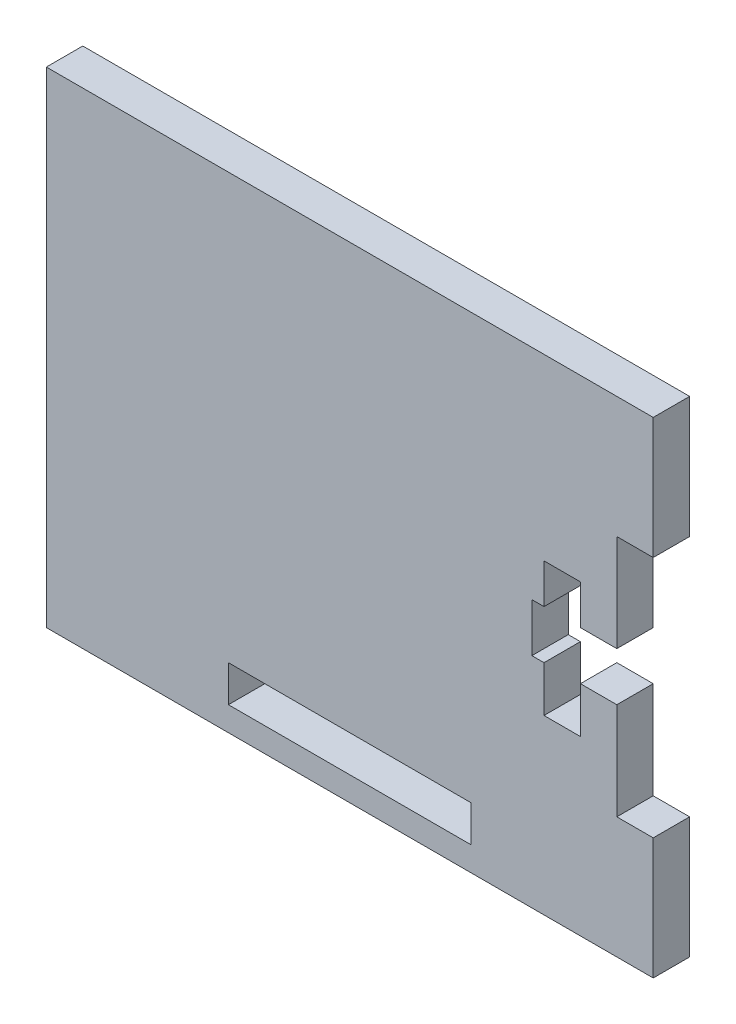
ISO-10303-21;
HEADER;
FILE_DESCRIPTION(('STEP AP214'),'2;1');
FILE_NAME('part.step','',(''),(''),'','','');
FILE_SCHEMA(('AUTOMOTIVE_DESIGN { 1 0 10303 214 1 1 1 1 }'));
ENDSEC;
DATA;
#1=APPLICATION_CONTEXT('core data for automotive mechanical design processes');
#2=APPLICATION_PROTOCOL_DEFINITION('international standard','automotive_design',2000,#1);
#3=PRODUCT_CONTEXT('',#1,'mechanical');
#4=PRODUCT('Part','Part','',(#3));
#5=PRODUCT_RELATED_PRODUCT_CATEGORY('part','',(#4));
#6=PRODUCT_DEFINITION_FORMATION('','',#4);
#7=PRODUCT_DEFINITION_CONTEXT('part definition',#1,'design');
#8=PRODUCT_DEFINITION('design','',#6,#7);
#9=PRODUCT_DEFINITION_SHAPE('','',#8);
#10=(LENGTH_UNIT() NAMED_UNIT(*) SI_UNIT(.MILLI.,.METRE.));
#11=(NAMED_UNIT(*) PLANE_ANGLE_UNIT() SI_UNIT($,.RADIAN.));
#12=(NAMED_UNIT(*) SI_UNIT($,.STERADIAN.) SOLID_ANGLE_UNIT());
#13=UNCERTAINTY_MEASURE_WITH_UNIT(LENGTH_MEASURE(1.E-05),#10,'distance_accuracy_value','');
#14=(GEOMETRIC_REPRESENTATION_CONTEXT(3) GLOBAL_UNCERTAINTY_ASSIGNED_CONTEXT((#13)) GLOBAL_UNIT_ASSIGNED_CONTEXT((#10,
#11,#12)) REPRESENTATION_CONTEXT('',''));
#15=CARTESIAN_POINT('',(0.,0.,0.));
#16=DIRECTION('',(0.,0.,1.));
#17=DIRECTION('',(1.,0.,0.));
#18=AXIS2_PLACEMENT_3D('',#15,#16,#17);
#19=CARTESIAN_POINT('',(0.,0.,1.5));
#20=DIRECTION('',(0.,0.,1.));
#21=DIRECTION('',(1.,0.,0.));
#22=AXIS2_PLACEMENT_3D('',#19,#20,#21);
#23=PLANE('',#22);
#24=DIRECTION('',(0.,-1.,0.));
#25=VECTOR('',#24,1.);
#26=CARTESIAN_POINT('',(-25.,20.,1.5));
#27=LINE('',#26,#25);
#28=CARTESIAN_POINT('',(-25.,20.,1.5));
#29=VERTEX_POINT('',#28);
#30=CARTESIAN_POINT('',(-25.,-20.,1.5));
#31=VERTEX_POINT('',#30);
#32=EDGE_CURVE('E232',#29,#31,#27,.T.);
#33=ORIENTED_EDGE('',*,*,#32,.T.);
#34=DIRECTION('',(1.,0.,0.));
#35=VECTOR('',#34,1.);
#36=CARTESIAN_POINT('',(-25.,-20.,1.5));
#37=LINE('',#36,#35);
#38=CARTESIAN_POINT('',(25.,-20.,1.5));
#39=VERTEX_POINT('',#38);
#40=EDGE_CURVE('E235',#31,#39,#37,.T.);
#41=ORIENTED_EDGE('',*,*,#40,.T.);
#42=DIRECTION('',(0.,1.,0.));
#43=VECTOR('',#42,1.);
#44=CARTESIAN_POINT('',(25.,-10.,1.5));
#45=LINE('',#44,#43);
#46=CARTESIAN_POINT('',(25.,-10.,1.5));
#47=VERTEX_POINT('',#46);
#48=EDGE_CURVE('E238',#39,#47,#45,.T.);
#49=ORIENTED_EDGE('',*,*,#48,.T.);
#50=DIRECTION('',(-1.,0.,0.));
#51=VECTOR('',#50,1.);
#52=CARTESIAN_POINT('',(25.,-10.,1.5));
#53=LINE('',#52,#51);
#54=CARTESIAN_POINT('',(22.,-10.,1.5));
#55=VERTEX_POINT('',#54);
#56=EDGE_CURVE('E240',#47,#55,#53,.T.);
#57=ORIENTED_EDGE('',*,*,#56,.T.);
#58=DIRECTION('',(0.,1.,0.));
#59=VECTOR('',#58,1.);
#60=CARTESIAN_POINT('',(22.,-2.,1.5));
#61=LINE('',#60,#59);
#62=CARTESIAN_POINT('',(22.,-2.,1.5));
#63=VERTEX_POINT('',#62);
#64=EDGE_CURVE('E242',#55,#63,#61,.T.);
#65=ORIENTED_EDGE('',*,*,#64,.T.);
#66=DIRECTION('',(-1.,0.,0.));
#67=VECTOR('',#66,1.);
#68=CARTESIAN_POINT('',(22.,-2.,1.5));
#69=LINE('',#68,#67);
#70=CARTESIAN_POINT('',(19.,-2.,1.5));
#71=VERTEX_POINT('',#70);
#72=EDGE_CURVE('E244',#63,#71,#69,.T.);
#73=ORIENTED_EDGE('',*,*,#72,.T.);
#74=DIRECTION('',(0.,-1.,0.));
#75=VECTOR('',#74,1.);
#76=CARTESIAN_POINT('',(19.,-2.,1.5));
#77=LINE('',#76,#75);
#78=CARTESIAN_POINT('',(19.,-5.76969494185854,1.5));
#79=VERTEX_POINT('',#78);
#80=EDGE_CURVE('E246',#71,#79,#77,.T.);
#81=ORIENTED_EDGE('',*,*,#80,.T.);
#82=DIRECTION('',(-1.,0.,0.));
#83=VECTOR('',#82,1.);
#84=CARTESIAN_POINT('',(16.,-5.76969494185854,1.5));
#85=LINE('',#84,#83);
#86=CARTESIAN_POINT('',(16.,-5.76969494185854,1.5));
#87=VERTEX_POINT('',#86);
#88=EDGE_CURVE('E248',#79,#87,#85,.T.);
#89=ORIENTED_EDGE('',*,*,#88,.T.);
#90=DIRECTION('',(0.,1.,0.));
#91=VECTOR('',#90,1.);
#92=CARTESIAN_POINT('',(16.,-2.,1.5));
#93=LINE('',#92,#91);
#94=CARTESIAN_POINT('',(16.,-2.,1.5));
#95=VERTEX_POINT('',#94);
#96=EDGE_CURVE('E250',#87,#95,#93,.T.);
#97=ORIENTED_EDGE('',*,*,#96,.T.);
#98=DIRECTION('',(-1.,0.,0.));
#99=VECTOR('',#98,1.);
#100=CARTESIAN_POINT('',(16.,-2.,1.5));
#101=LINE('',#100,#99);
#102=CARTESIAN_POINT('',(15.,-2.,1.5));
#103=VERTEX_POINT('',#102);
#104=EDGE_CURVE('E252',#95,#103,#101,.T.);
#105=ORIENTED_EDGE('',*,*,#104,.T.);
#106=DIRECTION('',(0.,1.,0.));
#107=VECTOR('',#106,1.);
#108=CARTESIAN_POINT('',(15.,2.,1.5));
#109=LINE('',#108,#107);
#110=CARTESIAN_POINT('',(15.,2.,1.5));
#111=VERTEX_POINT('',#110);
#112=EDGE_CURVE('E254',#103,#111,#109,.T.);
#113=ORIENTED_EDGE('',*,*,#112,.T.);
#114=DIRECTION('',(1.,0.,0.));
#115=VECTOR('',#114,1.);
#116=CARTESIAN_POINT('',(16.,2.,1.5));
#117=LINE('',#116,#115);
#118=CARTESIAN_POINT('',(16.,2.,1.5));
#119=VERTEX_POINT('',#118);
#120=EDGE_CURVE('E256',#111,#119,#117,.T.);
#121=ORIENTED_EDGE('',*,*,#120,.T.);
#122=DIRECTION('',(0.,1.,0.));
#123=VECTOR('',#122,1.);
#124=CARTESIAN_POINT('',(16.,5.26590984120979,1.5));
#125=LINE('',#124,#123);
#126=CARTESIAN_POINT('',(16.,5.26590984120979,1.5));
#127=VERTEX_POINT('',#126);
#128=EDGE_CURVE('E258',#119,#127,#125,.T.);
#129=ORIENTED_EDGE('',*,*,#128,.T.);
#130=DIRECTION('',(1.,0.,0.));
#131=VECTOR('',#130,1.);
#132=CARTESIAN_POINT('',(16.,5.26590984120979,1.5));
#133=LINE('',#132,#131);
#134=CARTESIAN_POINT('',(19.,5.26590984120979,1.5));
#135=VERTEX_POINT('',#134);
#136=EDGE_CURVE('E260',#127,#135,#133,.T.);
#137=ORIENTED_EDGE('',*,*,#136,.T.);
#138=DIRECTION('',(0.,-1.,0.));
#139=VECTOR('',#138,1.);
#140=CARTESIAN_POINT('',(19.,5.26590984120979,1.5));
#141=LINE('',#140,#139);
#142=CARTESIAN_POINT('',(19.,2.,1.5));
#143=VERTEX_POINT('',#142);
#144=EDGE_CURVE('E262',#135,#143,#141,.T.);
#145=ORIENTED_EDGE('',*,*,#144,.T.);
#146=DIRECTION('',(1.,0.,0.));
#147=VECTOR('',#146,1.);
#148=CARTESIAN_POINT('',(22.,2.,1.5));
#149=LINE('',#148,#147);
#150=CARTESIAN_POINT('',(22.,2.,1.5));
#151=VERTEX_POINT('',#150);
#152=EDGE_CURVE('E264',#143,#151,#149,.T.);
#153=ORIENTED_EDGE('',*,*,#152,.T.);
#154=DIRECTION('',(0.,1.,0.));
#155=VECTOR('',#154,1.);
#156=CARTESIAN_POINT('',(22.,10.,1.5));
#157=LINE('',#156,#155);
#158=CARTESIAN_POINT('',(22.,10.,1.5));
#159=VERTEX_POINT('',#158);
#160=EDGE_CURVE('E266',#151,#159,#157,.T.);
#161=ORIENTED_EDGE('',*,*,#160,.T.);
#162=DIRECTION('',(1.,0.,0.));
#163=VECTOR('',#162,1.);
#164=CARTESIAN_POINT('',(25.,10.,1.5));
#165=LINE('',#164,#163);
#166=CARTESIAN_POINT('',(25.,10.,1.5));
#167=VERTEX_POINT('',#166);
#168=EDGE_CURVE('E268',#159,#167,#165,.T.);
#169=ORIENTED_EDGE('',*,*,#168,.T.);
#170=DIRECTION('',(0.,1.,0.));
#171=VECTOR('',#170,1.);
#172=CARTESIAN_POINT('',(25.,20.,1.5));
#173=LINE('',#172,#171);
#174=CARTESIAN_POINT('',(25.,20.,1.5));
#175=VERTEX_POINT('',#174);
#176=EDGE_CURVE('E270',#167,#175,#173,.T.);
#177=ORIENTED_EDGE('',*,*,#176,.T.);
#178=DIRECTION('',(-1.,0.,0.));
#179=VECTOR('',#178,1.);
#180=CARTESIAN_POINT('',(-25.,20.,1.5));
#181=LINE('',#180,#179);
#182=EDGE_CURVE('E272',#175,#29,#181,.T.);
#183=ORIENTED_EDGE('',*,*,#182,.T.);
#184=EDGE_LOOP('',(#33,#41,#49,#57,#65,#73,#81,#89,#97,#105,#113,#121,#129,#137,#145,#153,#161,
#169,#177,#183));
#185=FACE_BOUND('',#184,.T.);
#186=DIRECTION('',(1.,0.,0.));
#187=VECTOR('',#186,1.);
#188=CARTESIAN_POINT('',(-10.,-18.,1.5));
#189=LINE('',#188,#187);
#190=CARTESIAN_POINT('',(-10.,-18.,1.5));
#191=VERTEX_POINT('',#190);
#192=CARTESIAN_POINT('',(10.,-18.,1.5));
#193=VERTEX_POINT('',#192);
#194=EDGE_CURVE('E204',#191,#193,#189,.T.);
#195=ORIENTED_EDGE('',*,*,#194,.F.);
#196=DIRECTION('',(0.,-1.,0.));
#197=VECTOR('',#196,1.);
#198=CARTESIAN_POINT('',(-10.,-15.,1.5));
#199=LINE('',#198,#197);
#200=CARTESIAN_POINT('',(-10.,-15.,1.5));
#201=VERTEX_POINT('',#200);
#202=EDGE_CURVE('E196',#201,#191,#199,.T.);
#203=ORIENTED_EDGE('',*,*,#202,.F.);
#204=DIRECTION('',(-1.,0.,0.));
#205=VECTOR('',#204,1.);
#206=CARTESIAN_POINT('',(-10.,-15.,1.5));
#207=LINE('',#206,#205);
#208=CARTESIAN_POINT('',(10.,-15.,1.5));
#209=VERTEX_POINT('',#208);
#210=EDGE_CURVE('E218',#209,#201,#207,.T.);
#211=ORIENTED_EDGE('',*,*,#210,.F.);
#212=DIRECTION('',(0.,1.,0.));
#213=VECTOR('',#212,1.);
#214=CARTESIAN_POINT('',(10.,-15.,1.5));
#215=LINE('',#214,#213);
#216=EDGE_CURVE('E216',#193,#209,#215,.T.);
#217=ORIENTED_EDGE('',*,*,#216,.F.);
#218=EDGE_LOOP('',(#195,#203,#211,#217));
#219=FACE_BOUND('',#218,.T.);
#220=ADVANCED_FACE('F35',(#185,#219),#23,.T.);
#221=CARTESIAN_POINT('',(0.,0.,-1.5));
#222=DIRECTION('',(0.,0.,1.));
#223=DIRECTION('',(1.,0.,0.));
#224=AXIS2_PLACEMENT_3D('',#221,#222,#223);
#225=PLANE('',#224);
#226=DIRECTION('',(0.,-1.,0.));
#227=VECTOR('',#226,1.);
#228=CARTESIAN_POINT('',(-25.,20.,-1.5));
#229=LINE('',#228,#227);
#230=CARTESIAN_POINT('',(-25.,20.,-1.5));
#231=VERTEX_POINT('',#230);
#232=CARTESIAN_POINT('',(-25.,-20.,-1.5));
#233=VERTEX_POINT('',#232);
#234=EDGE_CURVE('E212',#231,#233,#229,.T.);
#235=ORIENTED_EDGE('',*,*,#234,.F.);
#236=DIRECTION('',(-1.,0.,0.));
#237=VECTOR('',#236,1.);
#238=CARTESIAN_POINT('',(-25.,20.,-1.5));
#239=LINE('',#238,#237);
#240=CARTESIAN_POINT('',(25.,20.,-1.5));
#241=VERTEX_POINT('',#240);
#242=EDGE_CURVE('E236',#241,#231,#239,.T.);
#243=ORIENTED_EDGE('',*,*,#242,.F.);
#244=DIRECTION('',(0.,1.,0.));
#245=VECTOR('',#244,1.);
#246=CARTESIAN_POINT('',(25.,20.,-1.5));
#247=LINE('',#246,#245);
#248=CARTESIAN_POINT('',(25.,10.,-1.5));
#249=VERTEX_POINT('',#248);
#250=EDGE_CURVE('E311',#249,#241,#247,.T.);
#251=ORIENTED_EDGE('',*,*,#250,.F.);
#252=DIRECTION('',(1.,0.,0.));
#253=VECTOR('',#252,1.);
#254=CARTESIAN_POINT('',(25.,10.,-1.5));
#255=LINE('',#254,#253);
#256=CARTESIAN_POINT('',(22.,10.,-1.5));
#257=VERTEX_POINT('',#256);
#258=EDGE_CURVE('E309',#257,#249,#255,.T.);
#259=ORIENTED_EDGE('',*,*,#258,.F.);
#260=DIRECTION('',(0.,1.,0.));
#261=VECTOR('',#260,1.);
#262=CARTESIAN_POINT('',(22.,10.,-1.5));
#263=LINE('',#262,#261);
#264=CARTESIAN_POINT('',(22.,2.,-1.5));
#265=VERTEX_POINT('',#264);
#266=EDGE_CURVE('E307',#265,#257,#263,.T.);
#267=ORIENTED_EDGE('',*,*,#266,.F.);
#268=DIRECTION('',(1.,0.,0.));
#269=VECTOR('',#268,1.);
#270=CARTESIAN_POINT('',(22.,2.,-1.5));
#271=LINE('',#270,#269);
#272=CARTESIAN_POINT('',(19.,2.,-1.5));
#273=VERTEX_POINT('',#272);
#274=EDGE_CURVE('E305',#273,#265,#271,.T.);
#275=ORIENTED_EDGE('',*,*,#274,.F.);
#276=DIRECTION('',(0.,-1.,0.));
#277=VECTOR('',#276,1.);
#278=CARTESIAN_POINT('',(19.,5.26590984120979,-1.5));
#279=LINE('',#278,#277);
#280=CARTESIAN_POINT('',(19.,5.26590984120979,-1.5));
#281=VERTEX_POINT('',#280);
#282=EDGE_CURVE('E303',#281,#273,#279,.T.);
#283=ORIENTED_EDGE('',*,*,#282,.F.);
#284=DIRECTION('',(1.,0.,0.));
#285=VECTOR('',#284,1.);
#286=CARTESIAN_POINT('',(16.,5.26590984120979,-1.5));
#287=LINE('',#286,#285);
#288=CARTESIAN_POINT('',(16.,5.26590984120979,-1.5));
#289=VERTEX_POINT('',#288);
#290=EDGE_CURVE('E301',#289,#281,#287,.T.);
#291=ORIENTED_EDGE('',*,*,#290,.F.);
#292=DIRECTION('',(0.,1.,0.));
#293=VECTOR('',#292,1.);
#294=CARTESIAN_POINT('',(16.,5.26590984120979,-1.5));
#295=LINE('',#294,#293);
#296=CARTESIAN_POINT('',(16.,2.,-1.5));
#297=VERTEX_POINT('',#296);
#298=EDGE_CURVE('E299',#297,#289,#295,.T.);
#299=ORIENTED_EDGE('',*,*,#298,.F.);
#300=DIRECTION('',(1.,0.,0.));
#301=VECTOR('',#300,1.);
#302=CARTESIAN_POINT('',(16.,2.,-1.5));
#303=LINE('',#302,#301);
#304=CARTESIAN_POINT('',(15.,2.,-1.5));
#305=VERTEX_POINT('',#304);
#306=EDGE_CURVE('E297',#305,#297,#303,.T.);
#307=ORIENTED_EDGE('',*,*,#306,.F.);
#308=DIRECTION('',(0.,1.,0.));
#309=VECTOR('',#308,1.);
#310=CARTESIAN_POINT('',(15.,2.,-1.5));
#311=LINE('',#310,#309);
#312=CARTESIAN_POINT('',(15.,-2.,-1.5));
#313=VERTEX_POINT('',#312);
#314=EDGE_CURVE('E295',#313,#305,#311,.T.);
#315=ORIENTED_EDGE('',*,*,#314,.F.);
#316=DIRECTION('',(-1.,0.,0.));
#317=VECTOR('',#316,1.);
#318=CARTESIAN_POINT('',(16.,-2.,-1.5));
#319=LINE('',#318,#317);
#320=CARTESIAN_POINT('',(16.,-2.,-1.5));
#321=VERTEX_POINT('',#320);
#322=EDGE_CURVE('E293',#321,#313,#319,.T.);
#323=ORIENTED_EDGE('',*,*,#322,.F.);
#324=DIRECTION('',(0.,1.,0.));
#325=VECTOR('',#324,1.);
#326=CARTESIAN_POINT('',(16.,-2.,-1.5));
#327=LINE('',#326,#325);
#328=CARTESIAN_POINT('',(16.,-5.76969494185854,-1.5));
#329=VERTEX_POINT('',#328);
#330=EDGE_CURVE('E291',#329,#321,#327,.T.);
#331=ORIENTED_EDGE('',*,*,#330,.F.);
#332=DIRECTION('',(-1.,0.,0.));
#333=VECTOR('',#332,1.);
#334=CARTESIAN_POINT('',(16.,-5.76969494185854,-1.5));
#335=LINE('',#334,#333);
#336=CARTESIAN_POINT('',(19.,-5.76969494185854,-1.5));
#337=VERTEX_POINT('',#336);
#338=EDGE_CURVE('E289',#337,#329,#335,.T.);
#339=ORIENTED_EDGE('',*,*,#338,.F.);
#340=DIRECTION('',(0.,-1.,0.));
#341=VECTOR('',#340,1.);
#342=CARTESIAN_POINT('',(19.,-2.,-1.5));
#343=LINE('',#342,#341);
#344=CARTESIAN_POINT('',(19.,-2.,-1.5));
#345=VERTEX_POINT('',#344);
#346=EDGE_CURVE('E287',#345,#337,#343,.T.);
#347=ORIENTED_EDGE('',*,*,#346,.F.);
#348=DIRECTION('',(-1.,0.,0.));
#349=VECTOR('',#348,1.);
#350=CARTESIAN_POINT('',(22.,-2.,-1.5));
#351=LINE('',#350,#349);
#352=CARTESIAN_POINT('',(22.,-2.,-1.5));
#353=VERTEX_POINT('',#352);
#354=EDGE_CURVE('E285',#353,#345,#351,.T.);
#355=ORIENTED_EDGE('',*,*,#354,.F.);
#356=DIRECTION('',(0.,1.,0.));
#357=VECTOR('',#356,1.);
#358=CARTESIAN_POINT('',(22.,-2.,-1.5));
#359=LINE('',#358,#357);
#360=CARTESIAN_POINT('',(22.,-10.,-1.5));
#361=VERTEX_POINT('',#360);
#362=EDGE_CURVE('E283',#361,#353,#359,.T.);
#363=ORIENTED_EDGE('',*,*,#362,.F.);
#364=DIRECTION('',(-1.,0.,0.));
#365=VECTOR('',#364,1.);
#366=CARTESIAN_POINT('',(25.,-10.,-1.5));
#367=LINE('',#366,#365);
#368=CARTESIAN_POINT('',(25.,-10.,-1.5));
#369=VERTEX_POINT('',#368);
#370=EDGE_CURVE('E281',#369,#361,#367,.T.);
#371=ORIENTED_EDGE('',*,*,#370,.F.);
#372=DIRECTION('',(0.,1.,0.));
#373=VECTOR('',#372,1.);
#374=CARTESIAN_POINT('',(25.,-10.,-1.5));
#375=LINE('',#374,#373);
#376=CARTESIAN_POINT('',(25.,-20.,-1.5));
#377=VERTEX_POINT('',#376);
#378=EDGE_CURVE('E279',#377,#369,#375,.T.);
#379=ORIENTED_EDGE('',*,*,#378,.F.);
#380=DIRECTION('',(1.,0.,0.));
#381=VECTOR('',#380,1.);
#382=CARTESIAN_POINT('',(-25.,-20.,-1.5));
#383=LINE('',#382,#381);
#384=EDGE_CURVE('E277',#233,#377,#383,.T.);
#385=ORIENTED_EDGE('',*,*,#384,.F.);
#386=EDGE_LOOP('',(#235,#243,#251,#259,#267,#275,#283,#291,#299,#307,#315,#323,#331,#339,#347,
#355,#363,#371,#379,#385));
#387=FACE_BOUND('',#386,.T.);
#388=DIRECTION('',(0.,-1.,0.));
#389=VECTOR('',#388,1.);
#390=CARTESIAN_POINT('',(-10.,-15.,-1.5));
#391=LINE('',#390,#389);
#392=CARTESIAN_POINT('',(-10.,-15.,-1.5));
#393=VERTEX_POINT('',#392);
#394=CARTESIAN_POINT('',(-10.,-18.,-1.5));
#395=VERTEX_POINT('',#394);
#396=EDGE_CURVE('E58',#393,#395,#391,.T.);
#397=ORIENTED_EDGE('',*,*,#396,.T.);
#398=DIRECTION('',(1.,0.,0.));
#399=VECTOR('',#398,1.);
#400=CARTESIAN_POINT('',(-10.,-18.,-1.5));
#401=LINE('',#400,#399);
#402=CARTESIAN_POINT('',(10.,-18.,-1.5));
#403=VERTEX_POINT('',#402);
#404=EDGE_CURVE('E211',#395,#403,#401,.T.);
#405=ORIENTED_EDGE('',*,*,#404,.T.);
#406=DIRECTION('',(0.,1.,0.));
#407=VECTOR('',#406,1.);
#408=CARTESIAN_POINT('',(10.,-15.,-1.5));
#409=LINE('',#408,#407);
#410=CARTESIAN_POINT('',(10.,-15.,-1.5));
#411=VERTEX_POINT('',#410);
#412=EDGE_CURVE('E224',#403,#411,#409,.T.);
#413=ORIENTED_EDGE('',*,*,#412,.T.);
#414=DIRECTION('',(-1.,0.,0.));
#415=VECTOR('',#414,1.);
#416=CARTESIAN_POINT('',(-10.,-15.,-1.5));
#417=LINE('',#416,#415);
#418=EDGE_CURVE('E205',#411,#393,#417,.T.);
#419=ORIENTED_EDGE('',*,*,#418,.T.);
#420=EDGE_LOOP('',(#397,#405,#413,#419));
#421=FACE_BOUND('',#420,.T.);
#422=ADVANCED_FACE('F377',(#387,#421),#225,.F.);
#423=CARTESIAN_POINT('',(-25.,20.,1.5));
#424=DIRECTION('',(1.,0.,0.));
#425=DIRECTION('',(0.,1.,0.));
#426=AXIS2_PLACEMENT_3D('',#423,#424,#425);
#427=PLANE('',#426);
#428=ORIENTED_EDGE('',*,*,#234,.T.);
#429=DIRECTION('',(0.,0.,-1.));
#430=VECTOR('',#429,1.);
#431=CARTESIAN_POINT('',(-25.,-20.,1.5));
#432=LINE('',#431,#430);
#433=EDGE_CURVE('E11',#31,#233,#432,.T.);
#434=ORIENTED_EDGE('',*,*,#433,.F.);
#435=ORIENTED_EDGE('',*,*,#32,.F.);
#436=DIRECTION('',(0.,0.,-1.));
#437=VECTOR('',#436,1.);
#438=CARTESIAN_POINT('',(-25.,20.,1.5));
#439=LINE('',#438,#437);
#440=EDGE_CURVE('E274',#29,#231,#439,.T.);
#441=ORIENTED_EDGE('',*,*,#440,.T.);
#442=EDGE_LOOP('',(#428,#434,#435,#441));
#443=FACE_BOUND('',#442,.T.);
#444=ADVANCED_FACE('F37',(#443),#427,.F.);
#445=CARTESIAN_POINT('',(-25.,-20.,1.5));
#446=DIRECTION('',(0.,1.,0.));
#447=DIRECTION('',(0.,0.,1.));
#448=AXIS2_PLACEMENT_3D('',#445,#446,#447);
#449=PLANE('',#448);
#450=ORIENTED_EDGE('',*,*,#384,.T.);
#451=DIRECTION('',(0.,0.,-1.));
#452=VECTOR('',#451,1.);
#453=CARTESIAN_POINT('',(25.,-20.,1.5));
#454=LINE('',#453,#452);
#455=EDGE_CURVE('E43',#39,#377,#454,.T.);
#456=ORIENTED_EDGE('',*,*,#455,.F.);
#457=ORIENTED_EDGE('',*,*,#40,.F.);
#458=ORIENTED_EDGE('',*,*,#433,.T.);
#459=EDGE_LOOP('',(#450,#456,#457,#458));
#460=FACE_BOUND('',#459,.T.);
#461=ADVANCED_FACE('F394',(#460),#449,.F.);
#462=CARTESIAN_POINT('',(25.,-10.,1.5));
#463=DIRECTION('',(-1.,0.,0.));
#464=DIRECTION('',(0.,-1.,0.));
#465=AXIS2_PLACEMENT_3D('',#462,#463,#464);
#466=PLANE('',#465);
#467=ORIENTED_EDGE('',*,*,#378,.T.);
#468=DIRECTION('',(0.,0.,-1.));
#469=VECTOR('',#468,1.);
#470=CARTESIAN_POINT('',(25.,-10.,1.5));
#471=LINE('',#470,#469);
#472=EDGE_CURVE('E364',#47,#369,#471,.T.);
#473=ORIENTED_EDGE('',*,*,#472,.F.);
#474=ORIENTED_EDGE('',*,*,#48,.F.);
#475=ORIENTED_EDGE('',*,*,#455,.T.);
#476=EDGE_LOOP('',(#467,#473,#474,#475));
#477=FACE_BOUND('',#476,.T.);
#478=ADVANCED_FACE('F371',(#477),#466,.F.);
#479=CARTESIAN_POINT('',(25.,-10.,1.5));
#480=DIRECTION('',(0.,-1.,0.));
#481=DIRECTION('',(0.,0.,-1.));
#482=AXIS2_PLACEMENT_3D('',#479,#480,#481);
#483=PLANE('',#482);
#484=ORIENTED_EDGE('',*,*,#370,.T.);
#485=DIRECTION('',(0.,0.,-1.));
#486=VECTOR('',#485,1.);
#487=CARTESIAN_POINT('',(22.,-10.,1.5));
#488=LINE('',#487,#486);
#489=EDGE_CURVE('E361',#55,#361,#488,.T.);
#490=ORIENTED_EDGE('',*,*,#489,.F.);
#491=ORIENTED_EDGE('',*,*,#56,.F.);
#492=ORIENTED_EDGE('',*,*,#472,.T.);
#493=EDGE_LOOP('',(#484,#490,#491,#492));
#494=FACE_BOUND('',#493,.T.);
#495=ADVANCED_FACE('F383',(#494),#483,.F.);
#496=CARTESIAN_POINT('',(22.,-2.,1.5));
#497=DIRECTION('',(-1.,0.,0.));
#498=DIRECTION('',(0.,-1.,0.));
#499=AXIS2_PLACEMENT_3D('',#496,#497,#498);
#500=PLANE('',#499);
#501=ORIENTED_EDGE('',*,*,#362,.T.);
#502=DIRECTION('',(0.,0.,-1.));
#503=VECTOR('',#502,1.);
#504=CARTESIAN_POINT('',(22.,-2.,1.5));
#505=LINE('',#504,#503);
#506=EDGE_CURVE('E358',#63,#353,#505,.T.);
#507=ORIENTED_EDGE('',*,*,#506,.F.);
#508=ORIENTED_EDGE('',*,*,#64,.F.);
#509=ORIENTED_EDGE('',*,*,#489,.T.);
#510=EDGE_LOOP('',(#501,#507,#508,#509));
#511=FACE_BOUND('',#510,.T.);
#512=ADVANCED_FACE('F387',(#511),#500,.F.);
#513=CARTESIAN_POINT('',(22.,-2.,1.5));
#514=DIRECTION('',(0.,-1.,0.));
#515=DIRECTION('',(0.,0.,-1.));
#516=AXIS2_PLACEMENT_3D('',#513,#514,#515);
#517=PLANE('',#516);
#518=ORIENTED_EDGE('',*,*,#354,.T.);
#519=DIRECTION('',(0.,0.,-1.));
#520=VECTOR('',#519,1.);
#521=CARTESIAN_POINT('',(19.,-2.,1.5));
#522=LINE('',#521,#520);
#523=EDGE_CURVE('E355',#71,#345,#522,.T.);
#524=ORIENTED_EDGE('',*,*,#523,.F.);
#525=ORIENTED_EDGE('',*,*,#72,.F.);
#526=ORIENTED_EDGE('',*,*,#506,.T.);
#527=EDGE_LOOP('',(#518,#524,#525,#526));
#528=FACE_BOUND('',#527,.T.);
#529=ADVANCED_FACE('F467',(#528),#517,.F.);
#530=CARTESIAN_POINT('',(19.,-2.,1.5));
#531=DIRECTION('',(1.,0.,0.));
#532=DIRECTION('',(0.,0.,-1.));
#533=AXIS2_PLACEMENT_3D('',#530,#531,#532);
#534=PLANE('',#533);
#535=ORIENTED_EDGE('',*,*,#346,.T.);
#536=DIRECTION('',(0.,0.,-1.));
#537=VECTOR('',#536,1.);
#538=CARTESIAN_POINT('',(19.,-5.76969494185854,1.5));
#539=LINE('',#538,#537);
#540=EDGE_CURVE('E352',#79,#337,#539,.T.);
#541=ORIENTED_EDGE('',*,*,#540,.F.);
#542=ORIENTED_EDGE('',*,*,#80,.F.);
#543=ORIENTED_EDGE('',*,*,#523,.T.);
#544=EDGE_LOOP('',(#535,#541,#542,#543));
#545=FACE_BOUND('',#544,.T.);
#546=ADVANCED_FACE('F465',(#545),#534,.F.);
#547=CARTESIAN_POINT('',(16.,-5.76969494185854,1.5));
#548=DIRECTION('',(0.,-1.,0.));
#549=DIRECTION('',(0.,0.,-1.));
#550=AXIS2_PLACEMENT_3D('',#547,#548,#549);
#551=PLANE('',#550);
#552=ORIENTED_EDGE('',*,*,#338,.T.);
#553=DIRECTION('',(0.,0.,-1.));
#554=VECTOR('',#553,1.);
#555=CARTESIAN_POINT('',(16.,-5.76969494185854,1.5));
#556=LINE('',#555,#554);
#557=EDGE_CURVE('E349',#87,#329,#556,.T.);
#558=ORIENTED_EDGE('',*,*,#557,.F.);
#559=ORIENTED_EDGE('',*,*,#88,.F.);
#560=ORIENTED_EDGE('',*,*,#540,.T.);
#561=EDGE_LOOP('',(#552,#558,#559,#560));
#562=FACE_BOUND('',#561,.T.);
#563=ADVANCED_FACE('F460',(#562),#551,.F.);
#564=CARTESIAN_POINT('',(16.,-2.,1.5));
#565=DIRECTION('',(-1.,0.,0.));
#566=DIRECTION('',(0.,0.,1.));
#567=AXIS2_PLACEMENT_3D('',#564,#565,#566);
#568=PLANE('',#567);
#569=ORIENTED_EDGE('',*,*,#330,.T.);
#570=DIRECTION('',(0.,0.,-1.));
#571=VECTOR('',#570,1.);
#572=CARTESIAN_POINT('',(16.,-2.,1.5));
#573=LINE('',#572,#571);
#574=EDGE_CURVE('E346',#95,#321,#573,.T.);
#575=ORIENTED_EDGE('',*,*,#574,.F.);
#576=ORIENTED_EDGE('',*,*,#96,.F.);
#577=ORIENTED_EDGE('',*,*,#557,.T.);
#578=EDGE_LOOP('',(#569,#575,#576,#577));
#579=FACE_BOUND('',#578,.T.);
#580=ADVANCED_FACE('F455',(#579),#568,.F.);
#581=CARTESIAN_POINT('',(16.,-2.,1.5));
#582=DIRECTION('',(0.,-1.,0.));
#583=DIRECTION('',(0.,0.,-1.));
#584=AXIS2_PLACEMENT_3D('',#581,#582,#583);
#585=PLANE('',#584);
#586=ORIENTED_EDGE('',*,*,#322,.T.);
#587=DIRECTION('',(0.,0.,-1.));
#588=VECTOR('',#587,1.);
#589=CARTESIAN_POINT('',(15.,-2.,1.5));
#590=LINE('',#589,#588);
#591=EDGE_CURVE('E343',#103,#313,#590,.T.);
#592=ORIENTED_EDGE('',*,*,#591,.F.);
#593=ORIENTED_EDGE('',*,*,#104,.F.);
#594=ORIENTED_EDGE('',*,*,#574,.T.);
#595=EDGE_LOOP('',(#586,#592,#593,#594));
#596=FACE_BOUND('',#595,.T.);
#597=ADVANCED_FACE('F451',(#596),#585,.F.);
#598=CARTESIAN_POINT('',(15.,2.,1.5));
#599=DIRECTION('',(-1.,0.,0.));
#600=DIRECTION('',(0.,-1.,0.));
#601=AXIS2_PLACEMENT_3D('',#598,#599,#600);
#602=PLANE('',#601);
#603=ORIENTED_EDGE('',*,*,#314,.T.);
#604=DIRECTION('',(0.,0.,-1.));
#605=VECTOR('',#604,1.);
#606=CARTESIAN_POINT('',(15.,2.,1.5));
#607=LINE('',#606,#605);
#608=EDGE_CURVE('E340',#111,#305,#607,.T.);
#609=ORIENTED_EDGE('',*,*,#608,.F.);
#610=ORIENTED_EDGE('',*,*,#112,.F.);
#611=ORIENTED_EDGE('',*,*,#591,.T.);
#612=EDGE_LOOP('',(#603,#609,#610,#611));
#613=FACE_BOUND('',#612,.T.);
#614=ADVANCED_FACE('F446',(#613),#602,.F.);
#615=CARTESIAN_POINT('',(16.,2.,1.5));
#616=DIRECTION('',(0.,1.,0.));
#617=DIRECTION('',(0.,0.,1.));
#618=AXIS2_PLACEMENT_3D('',#615,#616,#617);
#619=PLANE('',#618);
#620=ORIENTED_EDGE('',*,*,#306,.T.);
#621=DIRECTION('',(0.,0.,-1.));
#622=VECTOR('',#621,1.);
#623=CARTESIAN_POINT('',(16.,2.,1.5));
#624=LINE('',#623,#622);
#625=EDGE_CURVE('E337',#119,#297,#624,.T.);
#626=ORIENTED_EDGE('',*,*,#625,.F.);
#627=ORIENTED_EDGE('',*,*,#120,.F.);
#628=ORIENTED_EDGE('',*,*,#608,.T.);
#629=EDGE_LOOP('',(#620,#626,#627,#628));
#630=FACE_BOUND('',#629,.T.);
#631=ADVANCED_FACE('F440',(#630),#619,.F.);
#632=CARTESIAN_POINT('',(16.,5.26590984120979,1.5));
#633=DIRECTION('',(-1.,0.,0.));
#634=DIRECTION('',(0.,0.,1.));
#635=AXIS2_PLACEMENT_3D('',#632,#633,#634);
#636=PLANE('',#635);
#637=ORIENTED_EDGE('',*,*,#298,.T.);
#638=DIRECTION('',(0.,0.,-1.));
#639=VECTOR('',#638,1.);
#640=CARTESIAN_POINT('',(16.,5.26590984120979,1.5));
#641=LINE('',#640,#639);
#642=EDGE_CURVE('E334',#127,#289,#641,.T.);
#643=ORIENTED_EDGE('',*,*,#642,.F.);
#644=ORIENTED_EDGE('',*,*,#128,.F.);
#645=ORIENTED_EDGE('',*,*,#625,.T.);
#646=EDGE_LOOP('',(#637,#643,#644,#645));
#647=FACE_BOUND('',#646,.T.);
#648=ADVANCED_FACE('F436',(#647),#636,.F.);
#649=CARTESIAN_POINT('',(16.,5.26590984120979,1.5));
#650=DIRECTION('',(0.,1.,0.));
#651=DIRECTION('',(0.,0.,1.));
#652=AXIS2_PLACEMENT_3D('',#649,#650,#651);
#653=PLANE('',#652);
#654=ORIENTED_EDGE('',*,*,#290,.T.);
#655=DIRECTION('',(0.,0.,-1.));
#656=VECTOR('',#655,1.);
#657=CARTESIAN_POINT('',(19.,5.26590984120979,1.5));
#658=LINE('',#657,#656);
#659=EDGE_CURVE('E331',#135,#281,#658,.T.);
#660=ORIENTED_EDGE('',*,*,#659,.F.);
#661=ORIENTED_EDGE('',*,*,#136,.F.);
#662=ORIENTED_EDGE('',*,*,#642,.T.);
#663=EDGE_LOOP('',(#654,#660,#661,#662));
#664=FACE_BOUND('',#663,.T.);
#665=ADVANCED_FACE('F431',(#664),#653,.F.);
#666=CARTESIAN_POINT('',(19.,5.26590984120979,1.5));
#667=DIRECTION('',(1.,0.,0.));
#668=DIRECTION('',(0.,0.,-1.));
#669=AXIS2_PLACEMENT_3D('',#666,#667,#668);
#670=PLANE('',#669);
#671=ORIENTED_EDGE('',*,*,#282,.T.);
#672=DIRECTION('',(0.,0.,-1.));
#673=VECTOR('',#672,1.);
#674=CARTESIAN_POINT('',(19.,2.,1.5));
#675=LINE('',#674,#673);
#676=EDGE_CURVE('E328',#143,#273,#675,.T.);
#677=ORIENTED_EDGE('',*,*,#676,.F.);
#678=ORIENTED_EDGE('',*,*,#144,.F.);
#679=ORIENTED_EDGE('',*,*,#659,.T.);
#680=EDGE_LOOP('',(#671,#677,#678,#679));
#681=FACE_BOUND('',#680,.T.);
#682=ADVANCED_FACE('F425',(#681),#670,.F.);
#683=CARTESIAN_POINT('',(22.,2.,1.5));
#684=DIRECTION('',(0.,1.,0.));
#685=DIRECTION('',(0.,0.,1.));
#686=AXIS2_PLACEMENT_3D('',#683,#684,#685);
#687=PLANE('',#686);
#688=ORIENTED_EDGE('',*,*,#274,.T.);
#689=DIRECTION('',(0.,0.,-1.));
#690=VECTOR('',#689,1.);
#691=CARTESIAN_POINT('',(22.,2.,1.5));
#692=LINE('',#691,#690);
#693=EDGE_CURVE('E325',#151,#265,#692,.T.);
#694=ORIENTED_EDGE('',*,*,#693,.F.);
#695=ORIENTED_EDGE('',*,*,#152,.F.);
#696=ORIENTED_EDGE('',*,*,#676,.T.);
#697=EDGE_LOOP('',(#688,#694,#695,#696));
#698=FACE_BOUND('',#697,.T.);
#699=ADVANCED_FACE('F421',(#698),#687,.F.);
#700=CARTESIAN_POINT('',(22.,10.,1.5));
#701=DIRECTION('',(-1.,0.,0.));
#702=DIRECTION('',(0.,0.,1.));
#703=AXIS2_PLACEMENT_3D('',#700,#701,#702);
#704=PLANE('',#703);
#705=ORIENTED_EDGE('',*,*,#266,.T.);
#706=DIRECTION('',(0.,0.,-1.));
#707=VECTOR('',#706,1.);
#708=CARTESIAN_POINT('',(22.,10.,1.5));
#709=LINE('',#708,#707);
#710=EDGE_CURVE('E322',#159,#257,#709,.T.);
#711=ORIENTED_EDGE('',*,*,#710,.F.);
#712=ORIENTED_EDGE('',*,*,#160,.F.);
#713=ORIENTED_EDGE('',*,*,#693,.T.);
#714=EDGE_LOOP('',(#705,#711,#712,#713));
#715=FACE_BOUND('',#714,.T.);
#716=ADVANCED_FACE('F416',(#715),#704,.F.);
#717=CARTESIAN_POINT('',(25.,10.,1.5));
#718=DIRECTION('',(0.,1.,0.));
#719=DIRECTION('',(0.,0.,1.));
#720=AXIS2_PLACEMENT_3D('',#717,#718,#719);
#721=PLANE('',#720);
#722=ORIENTED_EDGE('',*,*,#258,.T.);
#723=DIRECTION('',(0.,0.,-1.));
#724=VECTOR('',#723,1.);
#725=CARTESIAN_POINT('',(25.,10.,1.5));
#726=LINE('',#725,#724);
#727=EDGE_CURVE('E319',#167,#249,#726,.T.);
#728=ORIENTED_EDGE('',*,*,#727,.F.);
#729=ORIENTED_EDGE('',*,*,#168,.F.);
#730=ORIENTED_EDGE('',*,*,#710,.T.);
#731=EDGE_LOOP('',(#722,#728,#729,#730));
#732=FACE_BOUND('',#731,.T.);
#733=ADVANCED_FACE('F410',(#732),#721,.F.);
#734=CARTESIAN_POINT('',(25.,20.,1.5));
#735=DIRECTION('',(-1.,0.,0.));
#736=DIRECTION('',(0.,0.,1.));
#737=AXIS2_PLACEMENT_3D('',#734,#735,#736);
#738=PLANE('',#737);
#739=ORIENTED_EDGE('',*,*,#250,.T.);
#740=DIRECTION('',(0.,0.,-1.));
#741=VECTOR('',#740,1.);
#742=CARTESIAN_POINT('',(25.,20.,1.5));
#743=LINE('',#742,#741);
#744=EDGE_CURVE('E316',#175,#241,#743,.T.);
#745=ORIENTED_EDGE('',*,*,#744,.F.);
#746=ORIENTED_EDGE('',*,*,#176,.F.);
#747=ORIENTED_EDGE('',*,*,#727,.T.);
#748=EDGE_LOOP('',(#739,#745,#746,#747));
#749=FACE_BOUND('',#748,.T.);
#750=ADVANCED_FACE('F406',(#749),#738,.F.);
#751=CARTESIAN_POINT('',(-25.,20.,1.5));
#752=DIRECTION('',(0.,-1.,0.));
#753=DIRECTION('',(0.,0.,-1.));
#754=AXIS2_PLACEMENT_3D('',#751,#752,#753);
#755=PLANE('',#754);
#756=ORIENTED_EDGE('',*,*,#242,.T.);
#757=ORIENTED_EDGE('',*,*,#440,.F.);
#758=ORIENTED_EDGE('',*,*,#182,.F.);
#759=ORIENTED_EDGE('',*,*,#744,.T.);
#760=EDGE_LOOP('',(#756,#757,#758,#759));
#761=FACE_BOUND('',#760,.T.);
#762=ADVANCED_FACE('F401',(#761),#755,.F.);
#763=CARTESIAN_POINT('',(-10.,-15.,1.5));
#764=DIRECTION('',(1.,0.,0.));
#765=DIRECTION('',(0.,1.,0.));
#766=AXIS2_PLACEMENT_3D('',#763,#764,#765);
#767=PLANE('',#766);
#768=ORIENTED_EDGE('',*,*,#396,.F.);
#769=DIRECTION('',(0.,0.,-1.));
#770=VECTOR('',#769,1.);
#771=CARTESIAN_POINT('',(-10.,-15.,1.5));
#772=LINE('',#771,#770);
#773=EDGE_CURVE('E200',#201,#393,#772,.T.);
#774=ORIENTED_EDGE('',*,*,#773,.F.);
#775=ORIENTED_EDGE('',*,*,#202,.T.);
#776=DIRECTION('',(0.,0.,-1.));
#777=VECTOR('',#776,1.);
#778=CARTESIAN_POINT('',(-10.,-18.,1.5));
#779=LINE('',#778,#777);
#780=EDGE_CURVE('E199',#191,#395,#779,.T.);
#781=ORIENTED_EDGE('',*,*,#780,.T.);
#782=EDGE_LOOP('',(#768,#774,#775,#781));
#783=FACE_BOUND('',#782,.T.);
#784=ADVANCED_FACE('F198',(#783),#767,.T.);
#785=CARTESIAN_POINT('',(-10.,-18.,1.5));
#786=DIRECTION('',(0.,1.,0.));
#787=DIRECTION('',(-1.,0.,0.));
#788=AXIS2_PLACEMENT_3D('',#785,#786,#787);
#789=PLANE('',#788);
#790=ORIENTED_EDGE('',*,*,#404,.F.);
#791=ORIENTED_EDGE('',*,*,#780,.F.);
#792=ORIENTED_EDGE('',*,*,#194,.T.);
#793=DIRECTION('',(0.,0.,-1.));
#794=VECTOR('',#793,1.);
#795=CARTESIAN_POINT('',(10.,-18.,1.5));
#796=LINE('',#795,#794);
#797=EDGE_CURVE('E213',#193,#403,#796,.T.);
#798=ORIENTED_EDGE('',*,*,#797,.T.);
#799=EDGE_LOOP('',(#790,#791,#792,#798));
#800=FACE_BOUND('',#799,.T.);
#801=ADVANCED_FACE('F208',(#800),#789,.T.);
#802=CARTESIAN_POINT('',(10.,-15.,1.5));
#803=DIRECTION('',(-1.,0.,0.));
#804=DIRECTION('',(0.,-1.,0.));
#805=AXIS2_PLACEMENT_3D('',#802,#803,#804);
#806=PLANE('',#805);
#807=ORIENTED_EDGE('',*,*,#412,.F.);
#808=ORIENTED_EDGE('',*,*,#797,.F.);
#809=ORIENTED_EDGE('',*,*,#216,.T.);
#810=DIRECTION('',(0.,0.,-1.));
#811=VECTOR('',#810,1.);
#812=CARTESIAN_POINT('',(10.,-15.,1.5));
#813=LINE('',#812,#811);
#814=EDGE_CURVE('E50',#209,#411,#813,.T.);
#815=ORIENTED_EDGE('',*,*,#814,.T.);
#816=EDGE_LOOP('',(#807,#808,#809,#815));
#817=FACE_BOUND('',#816,.T.);
#818=ADVANCED_FACE('F573',(#817),#806,.T.);
#819=CARTESIAN_POINT('',(-10.,-15.,1.5));
#820=DIRECTION('',(0.,-1.,0.));
#821=DIRECTION('',(1.,0.,0.));
#822=AXIS2_PLACEMENT_3D('',#819,#820,#821);
#823=PLANE('',#822);
#824=ORIENTED_EDGE('',*,*,#418,.F.);
#825=ORIENTED_EDGE('',*,*,#814,.F.);
#826=ORIENTED_EDGE('',*,*,#210,.T.);
#827=ORIENTED_EDGE('',*,*,#773,.T.);
#828=EDGE_LOOP('',(#824,#825,#826,#827));
#829=FACE_BOUND('',#828,.T.);
#830=ADVANCED_FACE('F579',(#829),#823,.T.);
#831=CLOSED_SHELL('',(#220,#422,#444,#461,#478,#495,#512,#529,#546,#563,#580,#597,#614,#631,
#648,#665,#682,#699,#716,#733,#750,#762,#784,#801,#818,#830));
#832=MANIFOLD_SOLID_BREP('B2',#831);
#833=ADVANCED_BREP_SHAPE_REPRESENTATION('',(#18,#832),#14);
#834=SHAPE_DEFINITION_REPRESENTATION(#9,#833);
ENDSEC;
END-ISO-10303-21;
